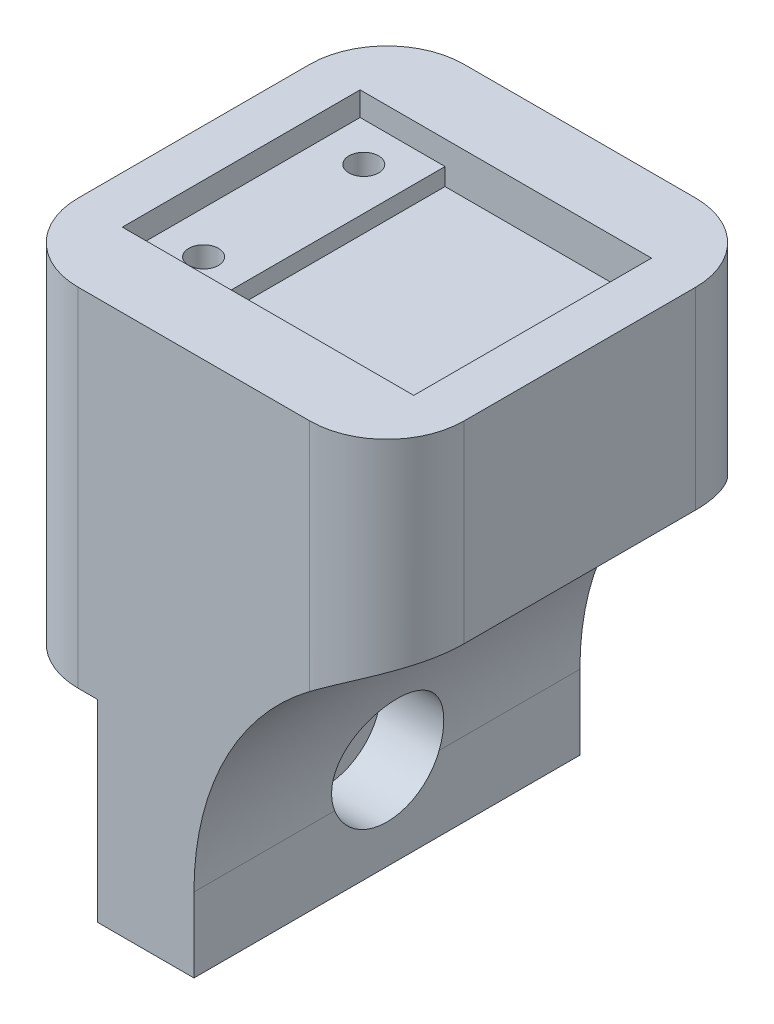
ISO-10303-21;
HEADER;
FILE_DESCRIPTION(('STEP AP214'),'2;1');
FILE_NAME('part.step','',(''),(''),'','','');
FILE_SCHEMA(('AUTOMOTIVE_DESIGN { 1 0 10303 214 1 1 1 1 }'));
ENDSEC;
DATA;
#1=APPLICATION_CONTEXT('core data for automotive mechanical design processes');
#2=APPLICATION_PROTOCOL_DEFINITION('international standard','automotive_design',2000,#1);
#3=PRODUCT_CONTEXT('',#1,'mechanical');
#4=PRODUCT('Part','Part','',(#3));
#5=PRODUCT_RELATED_PRODUCT_CATEGORY('part','',(#4));
#6=PRODUCT_DEFINITION_FORMATION('','',#4);
#7=PRODUCT_DEFINITION_CONTEXT('part definition',#1,'design');
#8=PRODUCT_DEFINITION('design','',#6,#7);
#9=PRODUCT_DEFINITION_SHAPE('','',#8);
#10=(LENGTH_UNIT() NAMED_UNIT(*) SI_UNIT(.MILLI.,.METRE.));
#11=(NAMED_UNIT(*) PLANE_ANGLE_UNIT() SI_UNIT($,.RADIAN.));
#12=(NAMED_UNIT(*) SI_UNIT($,.STERADIAN.) SOLID_ANGLE_UNIT());
#13=UNCERTAINTY_MEASURE_WITH_UNIT(LENGTH_MEASURE(1.E-05),#10,'distance_accuracy_value','');
#14=(GEOMETRIC_REPRESENTATION_CONTEXT(3) GLOBAL_UNCERTAINTY_ASSIGNED_CONTEXT((#13)) GLOBAL_UNIT_ASSIGNED_CONTEXT((#10,
#11,#12)) REPRESENTATION_CONTEXT('',''));
#15=CARTESIAN_POINT('',(0.,0.,0.));
#16=DIRECTION('',(0.,0.,1.));
#17=DIRECTION('',(1.,0.,0.));
#18=AXIS2_PLACEMENT_3D('',#15,#16,#17);
#19=CARTESIAN_POINT('',(6.35000000000001,-6.477,0.));
#20=DIRECTION('',(-1.,0.,0.));
#21=DIRECTION('',(0.,-1.,0.));
#22=AXIS2_PLACEMENT_3D('',#19,#20,#21);
#23=CYLINDRICAL_SURFACE('',#22,2.159);
#24=CARTESIAN_POINT('',(0.,-6.477,0.));
#25=DIRECTION('',(-1.,0.,0.));
#26=DIRECTION('',(0.,-1.,0.));
#27=AXIS2_PLACEMENT_3D('',#24,#25,#26);
#28=CIRCLE('',#27,2.159);
#29=CARTESIAN_POINT('',(0.,-8.636,0.));
#30=VERTEX_POINT('',#29);
#31=EDGE_CURVE('E243',#30,#30,#28,.T.);
#32=ORIENTED_EDGE('',*,*,#31,.T.);
#33=EDGE_LOOP('',(#32));
#34=FACE_BOUND('',#33,.T.);
#35=CARTESIAN_POINT('',(2.286,-6.477,0.));
#36=DIRECTION('',(1.,0.,0.));
#37=DIRECTION('',(0.,1.,0.));
#38=AXIS2_PLACEMENT_3D('',#35,#36,#37);
#39=CIRCLE('',#38,2.159);
#40=CARTESIAN_POINT('',(2.286,-4.318,0.));
#41=VERTEX_POINT('',#40);
#42=EDGE_CURVE('E236',#41,#41,#39,.T.);
#43=ORIENTED_EDGE('',*,*,#42,.T.);
#44=EDGE_LOOP('',(#43));
#45=FACE_BOUND('',#44,.T.);
#46=ADVANCED_FACE('F37',(#34,#45),#23,.F.);
#47=CARTESIAN_POINT('',(6.35,0.,12.7));
#48=DIRECTION('',(1.,0.,0.));
#49=DIRECTION('',(0.,1.,0.));
#50=AXIS2_PLACEMENT_3D('',#47,#48,#49);
#51=PLANE('',#50);
#52=DIRECTION('',(0.,-1.,0.));
#53=VECTOR('',#52,1.);
#54=CARTESIAN_POINT('',(6.35,0.,-12.7));
#55=LINE('',#54,#53);
#56=CARTESIAN_POINT('',(6.35,-7.80051224213831,-12.7));
#57=VERTEX_POINT('',#56);
#58=CARTESIAN_POINT('',(6.35,-12.7,-12.7));
#59=VERTEX_POINT('',#58);
#60=EDGE_CURVE('E248',#57,#59,#55,.T.);
#61=ORIENTED_EDGE('',*,*,#60,.F.);
#62=DIRECTION('',(0.,0.,1.));
#63=VECTOR('',#62,1.);
#64=CARTESIAN_POINT('',(6.35,-7.80051224213831,12.7));
#65=LINE('',#64,#63);
#66=CARTESIAN_POINT('',(6.35,-7.80051224213831,-3.43697604660114));
#67=VERTEX_POINT('',#66);
#68=EDGE_CURVE('E289',#57,#67,#65,.T.);
#69=ORIENTED_EDGE('',*,*,#68,.T.);
#70=CARTESIAN_POINT('',(6.35,-6.477,0.));
#71=DIRECTION('',(1.,0.,0.));
#72=DIRECTION('',(0.,1.,0.));
#73=AXIS2_PLACEMENT_3D('',#70,#71,#72);
#74=CIRCLE('',#73,3.683);
#75=CARTESIAN_POINT('',(6.35,-7.80051224213831,3.43697604660114));
#76=VERTEX_POINT('',#75);
#77=EDGE_CURVE('E239',#76,#67,#74,.T.);
#78=ORIENTED_EDGE('',*,*,#77,.F.);
#79=DIRECTION('',(0.,0.,1.));
#80=VECTOR('',#79,1.);
#81=CARTESIAN_POINT('',(6.35,-7.80051224213831,12.7));
#82=LINE('',#81,#80);
#83=CARTESIAN_POINT('',(6.35,-7.80051224213831,12.7));
#84=VERTEX_POINT('',#83);
#85=EDGE_CURVE('E287',#76,#84,#82,.T.);
#86=ORIENTED_EDGE('',*,*,#85,.T.);
#87=DIRECTION('',(0.,-1.,0.));
#88=VECTOR('',#87,1.);
#89=CARTESIAN_POINT('',(6.35,0.,12.7));
#90=LINE('',#89,#88);
#91=CARTESIAN_POINT('',(6.35,-12.7,12.7));
#92=VERTEX_POINT('',#91);
#93=EDGE_CURVE('E249',#84,#92,#90,.T.);
#94=ORIENTED_EDGE('',*,*,#93,.T.);
#95=DIRECTION('',(0.,0.,-1.));
#96=VECTOR('',#95,1.);
#97=CARTESIAN_POINT('',(6.35,-12.7,12.7));
#98=LINE('',#97,#96);
#99=EDGE_CURVE('E262',#92,#59,#98,.T.);
#100=ORIENTED_EDGE('',*,*,#99,.T.);
#101=EDGE_LOOP('',(#61,#69,#78,#86,#94,#100));
#102=FACE_BOUND('',#101,.T.);
#103=ADVANCED_FACE('F314',(#102),#51,.T.);
#104=CARTESIAN_POINT('',(0.,22.86,12.7));
#105=DIRECTION('',(0.,1.,0.));
#106=DIRECTION('',(0.,0.,1.));
#107=AXIS2_PLACEMENT_3D('',#104,#105,#106);
#108=PLANE('',#107);
#109=DIRECTION('',(0.,0.,1.));
#110=VECTOR('',#109,1.);
#111=CARTESIAN_POINT('',(-3.23850000000001,22.86,-7.8232));
#112=LINE('',#111,#110);
#113=CARTESIAN_POINT('',(-3.23850000000001,22.86,-7.8232));
#114=VERTEX_POINT('',#113);
#115=CARTESIAN_POINT('',(-3.23850000000001,22.86,7.8232));
#116=VERTEX_POINT('',#115);
#117=EDGE_CURVE('E205',#114,#116,#112,.T.);
#118=ORIENTED_EDGE('',*,*,#117,.F.);
#119=DIRECTION('',(-1.,0.,0.));
#120=VECTOR('',#119,1.);
#121=CARTESIAN_POINT('',(-3.23850000000001,22.86,-7.8232));
#122=LINE('',#121,#120);
#123=CARTESIAN_POINT('',(15.9385,22.86,-7.8232));
#124=VERTEX_POINT('',#123);
#125=EDGE_CURVE('E211',#124,#114,#122,.T.);
#126=ORIENTED_EDGE('',*,*,#125,.F.);
#127=DIRECTION('',(0.,0.,-1.));
#128=VECTOR('',#127,1.);
#129=CARTESIAN_POINT('',(15.9385,22.86,-7.8232));
#130=LINE('',#129,#128);
#131=CARTESIAN_POINT('',(15.9385,22.86,7.8232));
#132=VERTEX_POINT('',#131);
#133=EDGE_CURVE('E219',#132,#124,#130,.T.);
#134=ORIENTED_EDGE('',*,*,#133,.F.);
#135=DIRECTION('',(1.,0.,0.));
#136=VECTOR('',#135,1.);
#137=CARTESIAN_POINT('',(-3.23850000000001,22.86,7.8232));
#138=LINE('',#137,#136);
#139=EDGE_CURVE('E217',#116,#132,#138,.T.);
#140=ORIENTED_EDGE('',*,*,#139,.F.);
#141=EDGE_LOOP('',(#118,#126,#134,#140));
#142=FACE_BOUND('',#141,.T.);
#143=DIRECTION('',(1.,0.,0.));
#144=VECTOR('',#143,1.);
#145=CARTESIAN_POINT('',(0.,22.86,-12.7));
#146=LINE('',#145,#144);
#147=CARTESIAN_POINT('',(-1.27000000000001,22.86,-12.7));
#148=VERTEX_POINT('',#147);
#149=CARTESIAN_POINT('',(13.97,22.86,-12.7));
#150=VERTEX_POINT('',#149);
#151=EDGE_CURVE('E264',#148,#150,#146,.T.);
#152=ORIENTED_EDGE('',*,*,#151,.F.);
#153=CARTESIAN_POINT('',(-1.27000000000001,22.86,-7.62));
#154=DIRECTION('',(0.,1.,0.));
#155=DIRECTION('',(0.,0.,1.));
#156=AXIS2_PLACEMENT_3D('',#153,#154,#155);
#157=CIRCLE('',#156,5.08);
#158=CARTESIAN_POINT('',(-6.35000000000001,22.86,-7.62));
#159=VERTEX_POINT('',#158);
#160=EDGE_CURVE('E387',#148,#159,#157,.T.);
#161=ORIENTED_EDGE('',*,*,#160,.T.);
#162=DIRECTION('',(0.,0.,-1.));
#163=VECTOR('',#162,1.);
#164=CARTESIAN_POINT('',(-6.35000000000001,22.86,12.7));
#165=LINE('',#164,#163);
#166=CARTESIAN_POINT('',(-6.35000000000001,22.86,7.62));
#167=VERTEX_POINT('',#166);
#168=EDGE_CURVE('E284',#167,#159,#165,.T.);
#169=ORIENTED_EDGE('',*,*,#168,.F.);
#170=CARTESIAN_POINT('',(-1.27000000000001,22.86,7.62));
#171=DIRECTION('',(0.,1.,0.));
#172=DIRECTION('',(0.,0.,1.));
#173=AXIS2_PLACEMENT_3D('',#170,#171,#172);
#174=CIRCLE('',#173,5.08);
#175=CARTESIAN_POINT('',(-1.27000000000001,22.86,12.7));
#176=VERTEX_POINT('',#175);
#177=EDGE_CURVE('E400',#167,#176,#174,.T.);
#178=ORIENTED_EDGE('',*,*,#177,.T.);
#179=DIRECTION('',(1.,0.,0.));
#180=VECTOR('',#179,1.);
#181=CARTESIAN_POINT('',(0.,22.86,12.7));
#182=LINE('',#181,#180);
#183=CARTESIAN_POINT('',(13.97,22.86,12.7));
#184=VERTEX_POINT('',#183);
#185=EDGE_CURVE('E251',#176,#184,#182,.T.);
#186=ORIENTED_EDGE('',*,*,#185,.T.);
#187=CARTESIAN_POINT('',(13.97,22.86,7.62));
#188=DIRECTION('',(0.,1.,0.));
#189=DIRECTION('',(0.,0.,1.));
#190=AXIS2_PLACEMENT_3D('',#187,#188,#189);
#191=CIRCLE('',#190,5.08);
#192=CARTESIAN_POINT('',(19.05,22.86,7.62));
#193=VERTEX_POINT('',#192);
#194=EDGE_CURVE('E404',#184,#193,#191,.T.);
#195=ORIENTED_EDGE('',*,*,#194,.T.);
#196=DIRECTION('',(0.,0.,1.));
#197=VECTOR('',#196,1.);
#198=CARTESIAN_POINT('',(19.05,22.86,12.7));
#199=LINE('',#198,#197);
#200=CARTESIAN_POINT('',(19.05,22.86,-7.62));
#201=VERTEX_POINT('',#200);
#202=EDGE_CURVE('E233',#201,#193,#199,.T.);
#203=ORIENTED_EDGE('',*,*,#202,.F.);
#204=CARTESIAN_POINT('',(13.97,22.86,-7.62));
#205=DIRECTION('',(0.,1.,0.));
#206=DIRECTION('',(0.,0.,1.));
#207=AXIS2_PLACEMENT_3D('',#204,#205,#206);
#208=CIRCLE('',#207,5.08);
#209=EDGE_CURVE('E389',#201,#150,#208,.T.);
#210=ORIENTED_EDGE('',*,*,#209,.T.);
#211=EDGE_LOOP('',(#152,#161,#169,#178,#186,#195,#203,#210));
#212=FACE_BOUND('',#211,.T.);
#213=ADVANCED_FACE('F349',(#142,#212),#108,.T.);
#214=CARTESIAN_POINT('',(-6.35,0.,12.7));
#215=DIRECTION('',(1.,0.,0.));
#216=DIRECTION('',(0.,1.,0.));
#217=AXIS2_PLACEMENT_3D('',#214,#215,#216);
#218=PLANE('',#217);
#219=ORIENTED_EDGE('',*,*,#168,.T.);
#220=DIRECTION('',(0.,-1.,0.));
#221=VECTOR('',#220,1.);
#222=CARTESIAN_POINT('',(-6.35,0.,-7.62));
#223=LINE('',#222,#221);
#224=CARTESIAN_POINT('',(-6.35,0.,-7.62));
#225=VERTEX_POINT('',#224);
#226=EDGE_CURVE('E396',#159,#225,#223,.T.);
#227=ORIENTED_EDGE('',*,*,#226,.T.);
#228=DIRECTION('',(0.,0.,-1.));
#229=VECTOR('',#228,1.);
#230=CARTESIAN_POINT('',(-6.35,0.,12.7));
#231=LINE('',#230,#229);
#232=CARTESIAN_POINT('',(-6.35,0.,7.62));
#233=VERTEX_POINT('',#232);
#234=EDGE_CURVE('E281',#233,#225,#231,.T.);
#235=ORIENTED_EDGE('',*,*,#234,.F.);
#236=DIRECTION('',(0.,-1.,0.));
#237=VECTOR('',#236,1.);
#238=CARTESIAN_POINT('',(-6.35000000000001,22.86,7.62));
#239=LINE('',#238,#237);
#240=EDGE_CURVE('E413',#233,#167,#239,.F.);
#241=ORIENTED_EDGE('',*,*,#240,.T.);
#242=EDGE_LOOP('',(#219,#227,#235,#241));
#243=FACE_BOUND('',#242,.T.);
#244=ADVANCED_FACE('F372',(#243),#218,.F.);
#245=CARTESIAN_POINT('',(0.,0.,12.7));
#246=DIRECTION('',(0.,1.,0.));
#247=DIRECTION('',(-1.,0.,0.));
#248=AXIS2_PLACEMENT_3D('',#245,#246,#247);
#249=PLANE('',#248);
#250=ORIENTED_EDGE('',*,*,#234,.T.);
#251=CARTESIAN_POINT('',(-1.27,0.,-7.62));
#252=DIRECTION('',(0.,1.,0.));
#253=DIRECTION('',(-1.,0.,0.));
#254=AXIS2_PLACEMENT_3D('',#251,#252,#253);
#255=CIRCLE('',#254,5.08);
#256=CARTESIAN_POINT('',(-1.27,0.,-12.7));
#257=VERTEX_POINT('',#256);
#258=EDGE_CURVE('E409',#225,#257,#255,.F.);
#259=ORIENTED_EDGE('',*,*,#258,.T.);
#260=DIRECTION('',(1.,0.,0.));
#261=VECTOR('',#260,1.);
#262=CARTESIAN_POINT('',(0.,0.,-12.7));
#263=LINE('',#262,#261);
#264=CARTESIAN_POINT('',(0.,0.,-12.7));
#265=VERTEX_POINT('',#264);
#266=EDGE_CURVE('E267',#257,#265,#263,.T.);
#267=ORIENTED_EDGE('',*,*,#266,.T.);
#268=DIRECTION('',(0.,0.,-1.));
#269=VECTOR('',#268,1.);
#270=CARTESIAN_POINT('',(0.,0.,12.7));
#271=LINE('',#270,#269);
#272=CARTESIAN_POINT('',(0.,0.,12.7));
#273=VERTEX_POINT('',#272);
#274=EDGE_CURVE('E278',#273,#265,#271,.T.);
#275=ORIENTED_EDGE('',*,*,#274,.F.);
#276=DIRECTION('',(1.,0.,0.));
#277=VECTOR('',#276,1.);
#278=CARTESIAN_POINT('',(0.,0.,12.7));
#279=LINE('',#278,#277);
#280=CARTESIAN_POINT('',(-1.27,0.,12.7));
#281=VERTEX_POINT('',#280);
#282=EDGE_CURVE('E255',#281,#273,#279,.T.);
#283=ORIENTED_EDGE('',*,*,#282,.F.);
#284=CARTESIAN_POINT('',(-1.27,0.,7.62));
#285=DIRECTION('',(0.,1.,0.));
#286=DIRECTION('',(-1.,0.,0.));
#287=AXIS2_PLACEMENT_3D('',#284,#285,#286);
#288=CIRCLE('',#287,5.08);
#289=EDGE_CURVE('E411',#281,#233,#288,.F.);
#290=ORIENTED_EDGE('',*,*,#289,.T.);
#291=EDGE_LOOP('',(#250,#259,#267,#275,#283,#290));
#292=FACE_BOUND('',#291,.T.);
#293=ADVANCED_FACE('F368',(#292),#249,.F.);
#294=CARTESIAN_POINT('',(0.,0.,12.7));
#295=DIRECTION('',(1.,0.,0.));
#296=DIRECTION('',(0.,1.,0.));
#297=AXIS2_PLACEMENT_3D('',#294,#295,#296);
#298=PLANE('',#297);
#299=ORIENTED_EDGE('',*,*,#31,.F.);
#300=EDGE_LOOP('',(#299));
#301=FACE_BOUND('',#300,.T.);
#302=DIRECTION('',(0.,-1.,0.));
#303=VECTOR('',#302,1.);
#304=CARTESIAN_POINT('',(0.,0.,-12.7));
#305=LINE('',#304,#303);
#306=CARTESIAN_POINT('',(0.,-12.7,-12.7));
#307=VERTEX_POINT('',#306);
#308=EDGE_CURVE('E269',#265,#307,#305,.T.);
#309=ORIENTED_EDGE('',*,*,#308,.T.);
#310=DIRECTION('',(0.,0.,-1.));
#311=VECTOR('',#310,1.);
#312=CARTESIAN_POINT('',(0.,-12.7,12.7));
#313=LINE('',#312,#311);
#314=CARTESIAN_POINT('',(0.,-12.7,12.7));
#315=VERTEX_POINT('',#314);
#316=EDGE_CURVE('E275',#315,#307,#313,.T.);
#317=ORIENTED_EDGE('',*,*,#316,.F.);
#318=DIRECTION('',(0.,-1.,0.));
#319=VECTOR('',#318,1.);
#320=CARTESIAN_POINT('',(0.,0.,12.7));
#321=LINE('',#320,#319);
#322=EDGE_CURVE('E257',#273,#315,#321,.T.);
#323=ORIENTED_EDGE('',*,*,#322,.F.);
#324=ORIENTED_EDGE('',*,*,#274,.T.);
#325=EDGE_LOOP('',(#309,#317,#323,#324));
#326=FACE_BOUND('',#325,.T.);
#327=ADVANCED_FACE('F364',(#301,#326),#298,.F.);
#328=CARTESIAN_POINT('',(0.,-12.7,12.7));
#329=DIRECTION('',(0.,1.,0.));
#330=DIRECTION('',(-1.,0.,0.));
#331=AXIS2_PLACEMENT_3D('',#328,#329,#330);
#332=PLANE('',#331);
#333=DIRECTION('',(1.,0.,0.));
#334=VECTOR('',#333,1.);
#335=CARTESIAN_POINT('',(0.,-12.7,-12.7));
#336=LINE('',#335,#334);
#337=EDGE_CURVE('E252',#307,#59,#336,.T.);
#338=ORIENTED_EDGE('',*,*,#337,.T.);
#339=ORIENTED_EDGE('',*,*,#99,.F.);
#340=DIRECTION('',(1.,0.,0.));
#341=VECTOR('',#340,1.);
#342=CARTESIAN_POINT('',(0.,-12.7,12.7));
#343=LINE('',#342,#341);
#344=EDGE_CURVE('E259',#315,#92,#343,.T.);
#345=ORIENTED_EDGE('',*,*,#344,.F.);
#346=ORIENTED_EDGE('',*,*,#316,.T.);
#347=EDGE_LOOP('',(#338,#339,#345,#346));
#348=FACE_BOUND('',#347,.T.);
#349=ADVANCED_FACE('F357',(#348),#332,.F.);
#350=CARTESIAN_POINT('',(0.,0.,12.7));
#351=DIRECTION('',(0.,0.,1.));
#352=DIRECTION('',(1.,0.,0.));
#353=AXIS2_PLACEMENT_3D('',#350,#351,#352);
#354=PLANE('',#353);
#355=ORIENTED_EDGE('',*,*,#185,.F.);
#356=DIRECTION('',(0.,-1.,0.));
#357=VECTOR('',#356,1.);
#358=CARTESIAN_POINT('',(-1.27,0.,12.7));
#359=LINE('',#358,#357);
#360=EDGE_CURVE('E11',#176,#281,#359,.T.);
#361=ORIENTED_EDGE('',*,*,#360,.T.);
#362=ORIENTED_EDGE('',*,*,#282,.T.);
#363=ORIENTED_EDGE('',*,*,#322,.T.);
#364=ORIENTED_EDGE('',*,*,#344,.T.);
#365=ORIENTED_EDGE('',*,*,#93,.F.);
#366=CARTESIAN_POINT('',(25.4,-7.8005122421383,12.7));
#367=DIRECTION('',(0.,0.,1.));
#368=DIRECTION('',(1.,0.,0.));
#369=AXIS2_PLACEMENT_3D('',#366,#367,#368);
#370=CIRCLE('',#369,19.05);
#371=CARTESIAN_POINT('',(13.97,7.4394877578617,12.7));
#372=VERTEX_POINT('',#371);
#373=EDGE_CURVE('E301',#84,#372,#370,.F.);
#374=ORIENTED_EDGE('',*,*,#373,.T.);
#375=DIRECTION('',(0.,-1.,0.));
#376=VECTOR('',#375,1.);
#377=CARTESIAN_POINT('',(13.97,0.,12.7));
#378=LINE('',#377,#376);
#379=EDGE_CURVE('E46',#372,#184,#378,.F.);
#380=ORIENTED_EDGE('',*,*,#379,.T.);
#381=EDGE_LOOP('',(#355,#361,#362,#363,#364,#365,#374,#380));
#382=FACE_BOUND('',#381,.T.);
#383=ADVANCED_FACE('F353',(#382),#354,.T.);
#384=CARTESIAN_POINT('',(0.,0.,-12.7));
#385=DIRECTION('',(0.,0.,1.));
#386=DIRECTION('',(1.,0.,0.));
#387=AXIS2_PLACEMENT_3D('',#384,#385,#386);
#388=PLANE('',#387);
#389=ORIENTED_EDGE('',*,*,#266,.F.);
#390=DIRECTION('',(0.,-1.,0.));
#391=VECTOR('',#390,1.);
#392=CARTESIAN_POINT('',(-1.27,0.,-12.7));
#393=LINE('',#392,#391);
#394=EDGE_CURVE('E394',#257,#148,#393,.F.);
#395=ORIENTED_EDGE('',*,*,#394,.T.);
#396=ORIENTED_EDGE('',*,*,#151,.T.);
#397=DIRECTION('',(0.,1.,0.));
#398=VECTOR('',#397,1.);
#399=CARTESIAN_POINT('',(13.97,10.16,-12.7));
#400=LINE('',#399,#398);
#401=CARTESIAN_POINT('',(13.97,7.4394877578617,-12.7));
#402=VERTEX_POINT('',#401);
#403=EDGE_CURVE('E407',#150,#402,#400,.F.);
#404=ORIENTED_EDGE('',*,*,#403,.T.);
#405=CARTESIAN_POINT('',(25.4,-7.8005122421383,-12.7));
#406=DIRECTION('',(0.,0.,1.));
#407=DIRECTION('',(1.,0.,0.));
#408=AXIS2_PLACEMENT_3D('',#405,#406,#407);
#409=CIRCLE('',#408,19.05);
#410=EDGE_CURVE('E291',#402,#57,#409,.T.);
#411=ORIENTED_EDGE('',*,*,#410,.T.);
#412=ORIENTED_EDGE('',*,*,#60,.T.);
#413=ORIENTED_EDGE('',*,*,#337,.F.);
#414=ORIENTED_EDGE('',*,*,#308,.F.);
#415=EDGE_LOOP('',(#389,#395,#396,#404,#411,#412,#413,#414));
#416=FACE_BOUND('',#415,.T.);
#417=ADVANCED_FACE('F356',(#416),#388,.F.);
#418=CARTESIAN_POINT('',(2.286,-6.477,0.));
#419=DIRECTION('',(1.,0.,0.));
#420=DIRECTION('',(0.,1.,0.));
#421=AXIS2_PLACEMENT_3D('',#418,#419,#420);
#422=CYLINDRICAL_SURFACE('',#421,3.683);
#423=CARTESIAN_POINT('',(2.286,-6.477,0.));
#424=DIRECTION('',(1.,0.,0.));
#425=DIRECTION('',(0.,1.,0.));
#426=AXIS2_PLACEMENT_3D('',#423,#424,#425);
#427=CIRCLE('',#426,3.683);
#428=CARTESIAN_POINT('',(2.286,-2.794,0.));
#429=VERTEX_POINT('',#428);
#430=EDGE_CURVE('E240',#429,#429,#427,.T.);
#431=ORIENTED_EDGE('',*,*,#430,.F.);
#432=EDGE_LOOP('',(#431));
#433=FACE_BOUND('',#432,.T.);
#434=ORIENTED_EDGE('',*,*,#77,.T.);
#435=CARTESIAN_POINT('',(6.35,-7.80051224213831,-3.43697604660114));
#436=CARTESIAN_POINT('',(6.34999320728469,-7.70518619562024,-3.47369589744286));
#437=CARTESIAN_POINT('',(6.3507153291311,-7.60832823117715,-3.50642811391249));
#438=CARTESIAN_POINT('',(6.35370631729381,-7.41225683674622,-3.56373328164409));
#439=CARTESIAN_POINT('',(6.35597510111973,-7.31304353265153,-3.58830666794902));
#440=CARTESIAN_POINT('',(6.3621443019803,-7.11308938216757,-3.62908764705105));
#441=CARTESIAN_POINT('',(6.36604259707161,-7.01235068596767,-3.6453060585699));
#442=CARTESIAN_POINT('',(6.375499016466,-6.80998179432225,-3.66933369354177));
#443=CARTESIAN_POINT('',(6.38105711298576,-6.70835161382687,-3.67714305774322));
#444=CARTESIAN_POINT('',(6.40023371255698,-6.40310938836353,-3.68787064291266));
#445=CARTESIAN_POINT('',(6.41635727092941,-6.19905460426215,-3.67810680633451));
#446=CARTESIAN_POINT('',(6.4546654765816,-5.79604633874276,-3.62521220592292));
#447=CARTESIAN_POINT('',(6.47684977088027,-5.59709256097682,-3.58208338501939));
#448=CARTESIAN_POINT('',(6.52619273858322,-5.20809974484812,-3.46352399087587));
#449=CARTESIAN_POINT('',(6.55338612154298,-5.01813531789258,-3.38786278094376));
#450=CARTESIAN_POINT('',(6.6108078341255,-4.6536309135979,-3.20644518156167));
#451=CARTESIAN_POINT('',(6.64103704804404,-4.47909545850484,-3.10068000668959));
#452=CARTESIAN_POINT('',(6.70298153728171,-4.14629492881634,-2.85927926528496));
#453=CARTESIAN_POINT('',(6.73471487724529,-3.98847262164694,-2.72303737845573));
#454=CARTESIAN_POINT('',(6.79642887364752,-3.69785958187661,-2.42571314822963));
#455=CARTESIAN_POINT('',(6.82640952425889,-3.56506893249661,-2.26463072225044));
#456=CARTESIAN_POINT('',(6.88215047110165,-3.32762164942584,-1.92087825051074));
#457=CARTESIAN_POINT('',(6.90788647157101,-3.22312492021382,-1.73809357563943));
#458=CARTESIAN_POINT('',(6.95248823260638,-3.0465500873193,-1.35670131287096));
#459=CARTESIAN_POINT('',(6.97135512275023,-2.97446665303524,-1.15809633306647));
#460=CARTESIAN_POINT('',(6.99995075621327,-2.86657371084573,-0.756006387485977));
#461=CARTESIAN_POINT('',(7.00989725495566,-2.82989804724198,-0.55276952997625));
#462=CARTESIAN_POINT('',(7.02044932044491,-2.79101686716164,-0.142801554854217));
#463=CARTESIAN_POINT('',(7.02105667332611,-2.78880475944519,0.0639288870299611));
#464=CARTESIAN_POINT('',(7.01298404883436,-2.81850970520414,0.4691723025135));
#465=CARTESIAN_POINT('',(7.00455078372029,-2.84952012432668,0.66775755680657));
#466=CARTESIAN_POINT('',(6.97959477738464,-2.94319859243538,1.05677321500725));
#467=CARTESIAN_POINT('',(6.96307167800441,-3.00586804305566,1.2472032574558));
#468=CARTESIAN_POINT('',(6.92332243724394,-3.16140319327506,1.61605897546497));
#469=CARTESIAN_POINT('',(6.90005167906195,-3.25447042428585,1.79439466585896));
#470=CARTESIAN_POINT('',(6.84889598831358,-3.46795501221634,2.13312802212269));
#471=CARTESIAN_POINT('',(6.82101032830188,-3.58837668212314,2.29352285329062));
#472=CARTESIAN_POINT('',(6.76201795090239,-3.85746351435503,2.5970977044284));
#473=CARTESIAN_POINT('',(6.73083826386592,-4.00688731685883,2.7395914709766));
#474=CARTESIAN_POINT('',(6.66856178259532,-4.32742380311477,2.99769278675164));
#475=CARTESIAN_POINT('',(6.63746499980611,-4.49853933764069,3.11329679639774));
#476=CARTESIAN_POINT('',(6.57723565533645,-4.86106855003131,3.31619099416669));
#477=CARTESIAN_POINT('',(6.54814539212603,-5.05277745908596,3.40296729440961));
#478=CARTESIAN_POINT('',(6.49466548822156,-5.44876962200758,3.54278181432861));
#479=CARTESIAN_POINT('',(6.47027572441193,-5.65305254635073,3.59582091773374));
#480=CARTESIAN_POINT('',(6.42804869502356,-6.06557637732429,3.6658470296974));
#481=CARTESIAN_POINT('',(6.41012990539457,-6.27373057903828,3.68329646754119));
#482=CARTESIAN_POINT('',(6.38122809686976,-6.69041437832725,3.68269655482744));
#483=CARTESIAN_POINT('',(6.37023962199593,-6.8989435506633,3.66467517529832));
#484=CARTESIAN_POINT('',(6.35837361399868,-7.22327064310926,3.60862420123586));
#485=CARTESIAN_POINT('',(6.35518664695592,-7.34111591223146,3.5822260205699));
#486=CARTESIAN_POINT('',(6.35099699371923,-7.57350121751872,3.51805119218936));
#487=CARTESIAN_POINT('',(6.34999078214324,-7.68804629244744,3.48029302161677));
#488=CARTESIAN_POINT('',(6.35,-7.80051224213831,3.43697604660114));
#489=B_SPLINE_CURVE_WITH_KNOTS('',3,(#435,#436,#437,#438,#439,#440,#441,#442,#443,#444,#445,
#446,#447,#448,#449,#450,#451,#452,#453,#454,#455,#456,#457,#458,#459,#460,#461,#462,#463,#464,
#465,#466,#467,#468,#469,#470,#471,#472,#473,#474,#475,#476,#477,#478,#479,#480,#481,#482,#483,
#484,#485,#486,#487,#488),.UNSPECIFIED.,.F.,.F.,(4,2,2,2,2,2,2,2,2,2,2,2,2,2,2,2,2,2,2,2,2,2,2,
2,2,2,4),(0.,0.306363439106131,0.612710539758786,0.918659953051377,1.22460424536282,
1.83621751997945,2.4477951814435,3.06378199102805,3.67994875241037,4.30968002909534,
4.93941339936569,5.57263477938168,6.20575198342599,6.82295674479883,7.44004346279298,
8.04070907232122,8.64140127733159,9.24615965950294,9.85101346047609,10.4745833061032,
11.0982351877384,11.7324725810508,12.3666933601464,12.9926195897961,13.6180524339691,
13.9799322800358,14.3412266779406),.UNSPECIFIED.);
#490=EDGE_CURVE('E293',#67,#76,#489,.T.);
#491=ORIENTED_EDGE('',*,*,#490,.T.);
#492=EDGE_LOOP('',(#434,#491));
#493=FACE_BOUND('',#492,.T.);
#494=ADVANCED_FACE('F303',(#433,#493),#422,.F.);
#495=CARTESIAN_POINT('',(2.286,-6.477,0.));
#496=DIRECTION('',(1.,0.,0.));
#497=DIRECTION('',(0.,1.,0.));
#498=AXIS2_PLACEMENT_3D('',#495,#496,#497);
#499=PLANE('',#498);
#500=ORIENTED_EDGE('',*,*,#42,.F.);
#501=EDGE_LOOP('',(#500));
#502=FACE_BOUND('',#501,.T.);
#503=ORIENTED_EDGE('',*,*,#430,.T.);
#504=EDGE_LOOP('',(#503));
#505=FACE_BOUND('',#504,.T.);
#506=ADVANCED_FACE('F433',(#502,#505),#499,.T.);
#507=CARTESIAN_POINT('',(19.05,0.,0.));
#508=DIRECTION('',(1.,0.,0.));
#509=DIRECTION('',(0.,1.,0.));
#510=AXIS2_PLACEMENT_3D('',#507,#508,#509);
#511=PLANE('',#510);
#512=DIRECTION('',(0.,0.,-1.));
#513=VECTOR('',#512,1.);
#514=CARTESIAN_POINT('',(19.05,10.16,12.7));
#515=LINE('',#514,#513);
#516=CARTESIAN_POINT('',(19.05,10.16,7.62));
#517=VERTEX_POINT('',#516);
#518=CARTESIAN_POINT('',(19.05,10.16,-7.62));
#519=VERTEX_POINT('',#518);
#520=EDGE_CURVE('E226',#517,#519,#515,.T.);
#521=ORIENTED_EDGE('',*,*,#520,.T.);
#522=DIRECTION('',(0.,1.,0.));
#523=VECTOR('',#522,1.);
#524=CARTESIAN_POINT('',(19.05,22.86,-7.62));
#525=LINE('',#524,#523);
#526=EDGE_CURVE('E326',#519,#201,#525,.T.);
#527=ORIENTED_EDGE('',*,*,#526,.T.);
#528=ORIENTED_EDGE('',*,*,#202,.T.);
#529=DIRECTION('',(0.,-1.,0.));
#530=VECTOR('',#529,1.);
#531=CARTESIAN_POINT('',(19.05,0.,7.62));
#532=LINE('',#531,#530);
#533=EDGE_CURVE('E397',#193,#517,#532,.T.);
#534=ORIENTED_EDGE('',*,*,#533,.T.);
#535=EDGE_LOOP('',(#521,#527,#528,#534));
#536=FACE_BOUND('',#535,.T.);
#537=ADVANCED_FACE('F424',(#536),#511,.T.);
#538=CARTESIAN_POINT('',(-3.23850000000001,21.2852,-7.8232));
#539=DIRECTION('',(-1.,0.,0.));
#540=DIRECTION('',(0.,0.,1.));
#541=AXIS2_PLACEMENT_3D('',#538,#539,#540);
#542=PLANE('',#541);
#543=ORIENTED_EDGE('',*,*,#117,.T.);
#544=DIRECTION('',(0.,1.,0.));
#545=VECTOR('',#544,1.);
#546=CARTESIAN_POINT('',(-3.23850000000001,21.2852,7.8232));
#547=LINE('',#546,#545);
#548=CARTESIAN_POINT('',(-3.23850000000001,21.2852,7.8232));
#549=VERTEX_POINT('',#548);
#550=EDGE_CURVE('E215',#549,#116,#547,.T.);
#551=ORIENTED_EDGE('',*,*,#550,.F.);
#552=DIRECTION('',(0.,0.,1.));
#553=VECTOR('',#552,1.);
#554=CARTESIAN_POINT('',(-3.23850000000001,21.2852,-7.8232));
#555=LINE('',#554,#553);
#556=CARTESIAN_POINT('',(-3.23850000000001,21.2852,-7.8232));
#557=VERTEX_POINT('',#556);
#558=EDGE_CURVE('E207',#557,#549,#555,.T.);
#559=ORIENTED_EDGE('',*,*,#558,.F.);
#560=DIRECTION('',(0.,1.,0.));
#561=VECTOR('',#560,1.);
#562=CARTESIAN_POINT('',(-3.23850000000001,21.2852,-7.8232));
#563=LINE('',#562,#561);
#564=EDGE_CURVE('E224',#557,#114,#563,.T.);
#565=ORIENTED_EDGE('',*,*,#564,.T.);
#566=EDGE_LOOP('',(#543,#551,#559,#565));
#567=FACE_BOUND('',#566,.T.);
#568=ADVANCED_FACE('F444',(#567),#542,.F.);
#569=CARTESIAN_POINT('',(-3.23850000000001,21.2852,-7.8232));
#570=DIRECTION('',(0.,0.,-1.));
#571=DIRECTION('',(-1.,0.,0.));
#572=AXIS2_PLACEMENT_3D('',#569,#570,#571);
#573=PLANE('',#572);
#574=ORIENTED_EDGE('',*,*,#125,.T.);
#575=ORIENTED_EDGE('',*,*,#564,.F.);
#576=DIRECTION('',(-1.,0.,0.));
#577=VECTOR('',#576,1.);
#578=CARTESIAN_POINT('',(-3.23850000000001,21.2852,-7.8232));
#579=LINE('',#578,#577);
#580=CARTESIAN_POINT('',(2.34949999999999,21.2852,-7.8232));
#581=VERTEX_POINT('',#580);
#582=EDGE_CURVE('E213',#581,#557,#579,.T.);
#583=ORIENTED_EDGE('',*,*,#582,.F.);
#584=DIRECTION('',(0.,1.,0.));
#585=VECTOR('',#584,1.);
#586=CARTESIAN_POINT('',(2.34949999999999,20.1422,-7.8232));
#587=LINE('',#586,#585);
#588=CARTESIAN_POINT('',(2.34949999999999,20.1422,-7.8232));
#589=VERTEX_POINT('',#588);
#590=EDGE_CURVE('E181',#589,#581,#587,.T.);
#591=ORIENTED_EDGE('',*,*,#590,.F.);
#592=DIRECTION('',(-1.,0.,0.));
#593=VECTOR('',#592,1.);
#594=CARTESIAN_POINT('',(2.34949999999999,20.1422,-7.8232));
#595=LINE('',#594,#593);
#596=CARTESIAN_POINT('',(15.9385,20.1422,-7.8232));
#597=VERTEX_POINT('',#596);
#598=EDGE_CURVE('E182',#597,#589,#595,.T.);
#599=ORIENTED_EDGE('',*,*,#598,.F.);
#600=DIRECTION('',(0.,1.,0.));
#601=VECTOR('',#600,1.);
#602=CARTESIAN_POINT('',(15.9385,21.2852,-7.8232));
#603=LINE('',#602,#601);
#604=EDGE_CURVE('E227',#597,#124,#603,.T.);
#605=ORIENTED_EDGE('',*,*,#604,.T.);
#606=EDGE_LOOP('',(#574,#575,#583,#591,#599,#605));
#607=FACE_BOUND('',#606,.T.);
#608=ADVANCED_FACE('F450',(#607),#573,.F.);
#609=CARTESIAN_POINT('',(15.9385,21.2852,-7.8232));
#610=DIRECTION('',(1.,0.,0.));
#611=DIRECTION('',(0.,0.,-1.));
#612=AXIS2_PLACEMENT_3D('',#609,#610,#611);
#613=PLANE('',#612);
#614=ORIENTED_EDGE('',*,*,#133,.T.);
#615=ORIENTED_EDGE('',*,*,#604,.F.);
#616=DIRECTION('',(0.,0.,-1.));
#617=VECTOR('',#616,1.);
#618=CARTESIAN_POINT('',(15.9385,20.1422,-7.8232));
#619=LINE('',#618,#617);
#620=CARTESIAN_POINT('',(15.9385,20.1422,7.8232));
#621=VERTEX_POINT('',#620);
#622=EDGE_CURVE('E192',#621,#597,#619,.T.);
#623=ORIENTED_EDGE('',*,*,#622,.F.);
#624=DIRECTION('',(0.,1.,0.));
#625=VECTOR('',#624,1.);
#626=CARTESIAN_POINT('',(15.9385,21.2852,7.8232));
#627=LINE('',#626,#625);
#628=EDGE_CURVE('E188',#621,#132,#627,.T.);
#629=ORIENTED_EDGE('',*,*,#628,.T.);
#630=EDGE_LOOP('',(#614,#615,#623,#629));
#631=FACE_BOUND('',#630,.T.);
#632=ADVANCED_FACE('F455',(#631),#613,.F.);
#633=CARTESIAN_POINT('',(-3.23850000000001,21.2852,7.8232));
#634=DIRECTION('',(0.,0.,1.));
#635=DIRECTION('',(1.,0.,0.));
#636=AXIS2_PLACEMENT_3D('',#633,#634,#635);
#637=PLANE('',#636);
#638=ORIENTED_EDGE('',*,*,#139,.T.);
#639=ORIENTED_EDGE('',*,*,#628,.F.);
#640=DIRECTION('',(1.,0.,0.));
#641=VECTOR('',#640,1.);
#642=CARTESIAN_POINT('',(2.34949999999999,20.1422,7.8232));
#643=LINE('',#642,#641);
#644=CARTESIAN_POINT('',(2.34949999999999,20.1422,7.8232));
#645=VERTEX_POINT('',#644);
#646=EDGE_CURVE('E185',#645,#621,#643,.T.);
#647=ORIENTED_EDGE('',*,*,#646,.F.);
#648=DIRECTION('',(0.,1.,0.));
#649=VECTOR('',#648,1.);
#650=CARTESIAN_POINT('',(2.34949999999999,20.1422,7.8232));
#651=LINE('',#650,#649);
#652=CARTESIAN_POINT('',(2.34949999999999,21.2852,7.8232));
#653=VERTEX_POINT('',#652);
#654=EDGE_CURVE('E170',#645,#653,#651,.T.);
#655=ORIENTED_EDGE('',*,*,#654,.T.);
#656=DIRECTION('',(1.,0.,0.));
#657=VECTOR('',#656,1.);
#658=CARTESIAN_POINT('',(-3.23850000000001,21.2852,7.8232));
#659=LINE('',#658,#657);
#660=EDGE_CURVE('E210',#549,#653,#659,.T.);
#661=ORIENTED_EDGE('',*,*,#660,.F.);
#662=ORIENTED_EDGE('',*,*,#550,.T.);
#663=EDGE_LOOP('',(#638,#639,#647,#655,#661,#662));
#664=FACE_BOUND('',#663,.T.);
#665=ADVANCED_FACE('F187',(#664),#637,.F.);
#666=CARTESIAN_POINT('',(0.,21.2852,0.));
#667=DIRECTION('',(0.,1.,0.));
#668=DIRECTION('',(0.,0.,1.));
#669=AXIS2_PLACEMENT_3D('',#666,#667,#668);
#670=PLANE('',#669);
#671=CARTESIAN_POINT('',(-0.444500000000014,21.2852,5.27049999999999));
#672=DIRECTION('',(0.,-1.,0.));
#673=DIRECTION('',(0.,0.,-1.));
#674=AXIS2_PLACEMENT_3D('',#671,#672,#673);
#675=CIRCLE('',#674,0.9779);
#676=CARTESIAN_POINT('',(-0.444500000000014,21.2852,4.29259999999999));
#677=VERTEX_POINT('',#676);
#678=EDGE_CURVE('E487',#677,#677,#675,.T.);
#679=ORIENTED_EDGE('',*,*,#678,.T.);
#680=EDGE_LOOP('',(#679));
#681=FACE_BOUND('',#680,.T.);
#682=CARTESIAN_POINT('',(-0.444500000000004,21.2852,-5.27050000000001));
#683=DIRECTION('',(0.,-1.,0.));
#684=DIRECTION('',(0.,0.,-1.));
#685=AXIS2_PLACEMENT_3D('',#682,#683,#684);
#686=CIRCLE('',#685,0.9779);
#687=CARTESIAN_POINT('',(-0.444500000000004,21.2852,-6.24840000000001));
#688=VERTEX_POINT('',#687);
#689=EDGE_CURVE('E490',#688,#688,#686,.T.);
#690=ORIENTED_EDGE('',*,*,#689,.T.);
#691=EDGE_LOOP('',(#690));
#692=FACE_BOUND('',#691,.T.);
#693=DIRECTION('',(0.,0.,1.));
#694=VECTOR('',#693,1.);
#695=CARTESIAN_POINT('',(2.34949999999999,21.2852,-7.8232));
#696=LINE('',#695,#694);
#697=EDGE_CURVE('E177',#581,#653,#696,.T.);
#698=ORIENTED_EDGE('',*,*,#697,.F.);
#699=ORIENTED_EDGE('',*,*,#582,.T.);
#700=ORIENTED_EDGE('',*,*,#558,.T.);
#701=ORIENTED_EDGE('',*,*,#660,.T.);
#702=EDGE_LOOP('',(#698,#699,#700,#701));
#703=FACE_BOUND('',#702,.T.);
#704=ADVANCED_FACE('F454',(#681,#692,#703),#670,.T.);
#705=CARTESIAN_POINT('',(2.34949999999999,20.1422,-7.8232));
#706=DIRECTION('',(-1.,0.,0.));
#707=DIRECTION('',(0.,0.,1.));
#708=AXIS2_PLACEMENT_3D('',#705,#706,#707);
#709=PLANE('',#708);
#710=ORIENTED_EDGE('',*,*,#697,.T.);
#711=ORIENTED_EDGE('',*,*,#654,.F.);
#712=DIRECTION('',(0.,0.,1.));
#713=VECTOR('',#712,1.);
#714=CARTESIAN_POINT('',(2.34949999999999,20.1422,-7.8232));
#715=LINE('',#714,#713);
#716=EDGE_CURVE('E174',#589,#645,#715,.T.);
#717=ORIENTED_EDGE('',*,*,#716,.F.);
#718=ORIENTED_EDGE('',*,*,#590,.T.);
#719=EDGE_LOOP('',(#710,#711,#717,#718));
#720=FACE_BOUND('',#719,.T.);
#721=ADVANCED_FACE('F172',(#720),#709,.F.);
#722=CARTESIAN_POINT('',(0.,20.1422,0.));
#723=DIRECTION('',(0.,1.,0.));
#724=DIRECTION('',(0.,0.,1.));
#725=AXIS2_PLACEMENT_3D('',#722,#723,#724);
#726=PLANE('',#725);
#727=ORIENTED_EDGE('',*,*,#716,.T.);
#728=ORIENTED_EDGE('',*,*,#646,.T.);
#729=ORIENTED_EDGE('',*,*,#622,.T.);
#730=ORIENTED_EDGE('',*,*,#598,.T.);
#731=EDGE_LOOP('',(#727,#728,#729,#730));
#732=FACE_BOUND('',#731,.T.);
#733=ADVANCED_FACE('F194',(#732),#726,.T.);
#734=CARTESIAN_POINT('',(-0.444500000000004,8.5852,-5.27050000000001));
#735=DIRECTION('',(0.,1.,0.));
#736=DIRECTION('',(0.,0.,1.));
#737=AXIS2_PLACEMENT_3D('',#734,#735,#736);
#738=CYLINDRICAL_SURFACE('',#737,0.9779);
#739=CARTESIAN_POINT('',(-0.444500000000004,8.5852,-5.27050000000001));
#740=DIRECTION('',(0.,-1.,0.));
#741=DIRECTION('',(0.,0.,-1.));
#742=AXIS2_PLACEMENT_3D('',#739,#740,#741);
#743=CIRCLE('',#742,0.9779);
#744=CARTESIAN_POINT('',(-0.444500000000004,8.5852,-6.24840000000001));
#745=VERTEX_POINT('',#744);
#746=EDGE_CURVE('E200',#745,#745,#743,.T.);
#747=ORIENTED_EDGE('',*,*,#746,.T.);
#748=EDGE_LOOP('',(#747));
#749=FACE_BOUND('',#748,.T.);
#750=ORIENTED_EDGE('',*,*,#689,.F.);
#751=EDGE_LOOP('',(#750));
#752=FACE_BOUND('',#751,.T.);
#753=ADVANCED_FACE('F469',(#749,#752),#738,.F.);
#754=CARTESIAN_POINT('',(-0.444500000000004,8.5852,-5.27050000000001));
#755=DIRECTION('',(0.,-1.,0.));
#756=DIRECTION('',(0.,0.,-1.));
#757=AXIS2_PLACEMENT_3D('',#754,#755,#756);
#758=PLANE('',#757);
#759=ORIENTED_EDGE('',*,*,#746,.F.);
#760=EDGE_LOOP('',(#759));
#761=FACE_BOUND('',#760,.T.);
#762=ADVANCED_FACE('F470',(#761),#758,.F.);
#763=CARTESIAN_POINT('',(-0.444500000000014,8.5852,5.27049999999999));
#764=DIRECTION('',(0.,1.,0.));
#765=DIRECTION('',(0.,0.,1.));
#766=AXIS2_PLACEMENT_3D('',#763,#764,#765);
#767=CYLINDRICAL_SURFACE('',#766,0.9779);
#768=CARTESIAN_POINT('',(-0.444500000000014,8.5852,5.27049999999999));
#769=DIRECTION('',(0.,-1.,0.));
#770=DIRECTION('',(0.,0.,-1.));
#771=AXIS2_PLACEMENT_3D('',#768,#769,#770);
#772=CIRCLE('',#771,0.9779);
#773=CARTESIAN_POINT('',(-0.444500000000014,8.5852,4.29259999999999));
#774=VERTEX_POINT('',#773);
#775=EDGE_CURVE('E197',#774,#774,#772,.T.);
#776=ORIENTED_EDGE('',*,*,#775,.T.);
#777=EDGE_LOOP('',(#776));
#778=FACE_BOUND('',#777,.T.);
#779=ORIENTED_EDGE('',*,*,#678,.F.);
#780=EDGE_LOOP('',(#779));
#781=FACE_BOUND('',#780,.T.);
#782=ADVANCED_FACE('F473',(#778,#781),#767,.F.);
#783=CARTESIAN_POINT('',(-0.444500000000014,8.5852,5.27049999999999));
#784=DIRECTION('',(0.,-1.,0.));
#785=DIRECTION('',(0.,0.,-1.));
#786=AXIS2_PLACEMENT_3D('',#783,#784,#785);
#787=PLANE('',#786);
#788=ORIENTED_EDGE('',*,*,#775,.F.);
#789=EDGE_LOOP('',(#788));
#790=FACE_BOUND('',#789,.T.);
#791=ADVANCED_FACE('F313',(#790),#787,.F.);
#792=CARTESIAN_POINT('',(25.4,-7.8005122421383,12.7));
#793=DIRECTION('',(0.,0.,-1.));
#794=DIRECTION('',(-1.,0.,0.));
#795=AXIS2_PLACEMENT_3D('',#792,#793,#794);
#796=CYLINDRICAL_SURFACE('',#795,19.05);
#797=ORIENTED_EDGE('',*,*,#410,.F.);
#798=CARTESIAN_POINT('',(13.97,7.43948775786169,-12.7));
#799=CARTESIAN_POINT('',(14.1140326883675,7.54753977716261,-12.7000047836035));
#800=CARTESIAN_POINT('',(14.2596745219039,7.65355350473613,-12.6938727823497));
#801=CARTESIAN_POINT('',(14.553296615294,7.8610219781395,-12.6685538735921));
#802=CARTESIAN_POINT('',(14.7012793757414,7.96247133131081,-12.6493519349189));
#803=CARTESIAN_POINT('',(14.9990213890594,8.16051233707464,-12.5969931338001));
#804=CARTESIAN_POINT('',(15.1487855968158,8.25708061204003,-12.5637751463123));
#805=CARTESIAN_POINT('',(15.4480230992322,8.444233227248,-12.4827006514639));
#806=CARTESIAN_POINT('',(15.5974964989476,8.53482041443858,-12.4348511705483));
#807=CARTESIAN_POINT('',(15.8719607171466,8.69616383578777,-12.3324314683308));
#808=CARTESIAN_POINT('',(15.9972107651253,8.76783824660714,-12.279997114043));
#809=CARTESIAN_POINT('',(16.2453407594578,8.90621962935055,-12.1640047534961));
#810=CARTESIAN_POINT('',(16.3682202385484,8.97292562921544,-12.1004445786001));
#811=CARTESIAN_POINT('',(16.610122673228,9.10094467035513,-11.9622931370843));
#812=CARTESIAN_POINT('',(16.7291534465295,9.16226914276028,-11.8877262014563));
#813=CARTESIAN_POINT('',(16.9623745017227,9.27947629636414,-11.7275664060683));
#814=CARTESIAN_POINT('',(17.0765652185589,9.33535946712521,-11.641974539851));
#815=CARTESIAN_POINT('',(17.2994342830865,9.44183892470484,-11.4595463696484));
#816=CARTESIAN_POINT('',(17.4080791448133,9.49240469293679,-11.362651246732));
#817=CARTESIAN_POINT('',(17.6178313926912,9.5878064067693,-11.1585211766839));
#818=CARTESIAN_POINT('',(17.7189418663099,9.6326447048322,-11.0512905066642));
#819=CARTESIAN_POINT('',(17.9124859626605,9.71664437609985,-10.8270479875621));
#820=CARTESIAN_POINT('',(18.0049130538345,9.75580148783147,-10.7100288988263));
#821=CARTESIAN_POINT('',(18.1798195881085,9.8284544737612,-10.4671407689282));
#822=CARTESIAN_POINT('',(18.2622999955226,9.86195089688002,-10.3412725875462));
#823=CARTESIAN_POINT('',(18.4097927397619,9.92081022904296,-10.0926003400461));
#824=CARTESIAN_POINT('',(18.4756901570232,9.94661982515588,-9.97042573636799));
#825=CARTESIAN_POINT('',(18.5975422834667,9.99368166995787,-9.7203792681442));
#826=CARTESIAN_POINT('',(18.6534976628683,10.0149342258692,-9.59250778836757));
#827=CARTESIAN_POINT('',(18.7548253626094,10.0529771837755,-9.33211690139589));
#828=CARTESIAN_POINT('',(18.8002064767992,10.0697712951671,-9.19960146252601));
#829=CARTESIAN_POINT('',(18.8799515742526,10.0990203682515,-8.93088658199839));
#830=CARTESIAN_POINT('',(18.9143185901633,10.111476524449,-8.79468816563943));
#831=CARTESIAN_POINT('',(18.9785002393164,10.1346012225761,-8.4869031454182));
#832=CARTESIAN_POINT('',(19.0053013672534,10.1441448891342,-8.31458559325362));
#833=CARTESIAN_POINT('',(19.0321117591287,10.1536676085557,-8.05475662251644));
#834=CARTESIAN_POINT('',(19.0388166629001,10.1560430593315,-7.96796245784965));
#835=CARTESIAN_POINT('',(19.0477606442173,10.1592084804224,-7.7941189065562));
#836=CARTESIAN_POINT('',(19.0499998973774,10.1599985130849,-7.70706953010074));
#837=CARTESIAN_POINT('',(19.05,10.16,-7.62));
#838=B_SPLINE_CURVE_WITH_KNOTS('',3,(#798,#799,#800,#801,#802,#803,#804,#805,#806,#807,#808,
#809,#810,#811,#812,#813,#814,#815,#816,#817,#818,#819,#820,#821,#822,#823,#824,#825,#826,#827,
#828,#829,#830,#831,#832,#833,#834,#835,#836,#837),.UNSPECIFIED.,.F.,.F.,(4,2,2,2,2,2,2,2,2,2,2,
2,2,2,2,2,2,2,2,4),(0.,0.540145741635682,1.0809137334512,1.62406483592933,2.16695551088563,
2.62710236917538,3.08733901903005,3.54657312023668,4.00576586518454,4.46746473054175,
4.92897334685629,5.39082637185013,5.85263458491964,6.27568355833594,6.69870400205903,
7.12137138463917,7.54392228882276,8.0667034800873,8.32784977442862,8.58898579883325),.UNSPECIFIED.);
#839=EDGE_CURVE('E59',#402,#519,#838,.T.);
#840=ORIENTED_EDGE('',*,*,#839,.T.);
#841=ORIENTED_EDGE('',*,*,#520,.F.);
#842=CARTESIAN_POINT('',(19.05,10.16,7.62));
#843=CARTESIAN_POINT('',(19.0500186869022,10.1599949568691,7.75543718153517));
#844=CARTESIAN_POINT('',(19.044584491161,10.1580849668385,7.89087165513233));
#845=CARTESIAN_POINT('',(19.0229452012993,10.1504185310414,8.16075777771575));
#846=CARTESIAN_POINT('',(19.0067409311905,10.1446623795421,8.29520950109604));
#847=CARTESIAN_POINT('',(18.9637276668955,10.1292782804078,8.56197932583592));
#848=CARTESIAN_POINT('',(18.9369341520616,10.1196559839612,8.69430024945965));
#849=CARTESIAN_POINT('',(18.8730068265878,10.0964713815294,8.95606592148852));
#850=CARTESIAN_POINT('',(18.8358731091076,10.082909111041,9.08551069579488));
#851=CARTESIAN_POINT('',(18.7516177221191,10.0517572677912,9.34063441425064));
#852=CARTESIAN_POINT('',(18.7044942877222,10.0341669833543,9.46631268848649));
#853=CARTESIAN_POINT('',(18.600707611347,9.99485798808599,9.71305190391464));
#854=CARTESIAN_POINT('',(18.5440408678533,9.97313776156748,9.83411113027224));
#855=CARTESIAN_POINT('',(18.4217652597005,9.92548676513293,10.0706958057771));
#856=CARTESIAN_POINT('',(18.3561599896573,9.89955768700257,10.1862234543291));
#857=CARTESIAN_POINT('',(18.2166161857765,9.8433862285308,10.4110870189839));
#858=CARTESIAN_POINT('',(18.1426745713237,9.81314225255759,10.5204206235648));
#859=CARTESIAN_POINT('',(17.9865627923193,9.74801072858807,10.73306360778));
#860=CARTESIAN_POINT('',(17.9043291463314,9.71308655779639,10.836315142429));
#861=CARTESIAN_POINT('',(17.7329467818517,9.63874003939317,11.0352414839029));
#862=CARTESIAN_POINT('',(17.6437955573197,9.59931605917084,11.1309135192865));
#863=CARTESIAN_POINT('',(17.4595391211522,9.51600571911422,11.3141011436741));
#864=CARTESIAN_POINT('',(17.3644377920799,9.47212225774778,11.4016219606037));
#865=CARTESIAN_POINT('',(17.1691005391158,9.37989702451711,11.568245585375));
#866=CARTESIAN_POINT('',(17.0688627733701,9.33155364834606,11.6473453418066));
#867=CARTESIAN_POINT('',(16.8598922411373,9.22838080165701,11.7999953792455));
#868=CARTESIAN_POINT('',(16.7509795013646,9.17336410199177,11.8731725928265));
#869=CARTESIAN_POINT('',(16.5295784293005,9.05871871387228,12.0099773534773));
#870=CARTESIAN_POINT('',(16.4170886223977,8.9990881084732,12.0736008986397));
#871=CARTESIAN_POINT('',(16.1893802088456,8.87533249230265,12.1913461197824));
#872=CARTESIAN_POINT('',(16.0741577517172,8.81120085535455,12.2454533577176));
#873=CARTESIAN_POINT('',(15.8420549891455,8.67874893967673,12.3441633318001));
#874=CARTESIAN_POINT('',(15.725174469522,8.61042811595154,12.388764827898));
#875=CARTESIAN_POINT('',(15.4704454017107,8.45778103423399,12.4755269114201));
#876=CARTESIAN_POINT('',(15.3324438599312,8.37272137578939,12.5159521368695));
#877=CARTESIAN_POINT('',(15.0564825656945,8.19764011505417,12.5844920403424));
#878=CARTESIAN_POINT('',(14.9185228484071,8.10761666088667,12.6126020883914));
#879=CARTESIAN_POINT('',(14.6442267207765,7.92345007240642,12.6569683952078));
#880=CARTESIAN_POINT('',(14.5078861970306,7.82932338030262,12.6732680477861));
#881=CARTESIAN_POINT('',(14.2372447367329,7.63720353886465,12.6947803432734));
#882=CARTESIAN_POINT('',(14.1029420684365,7.53921396032769,12.7000029916784));
#883=CARTESIAN_POINT('',(13.97,7.43948775786169,12.7));
#884=B_SPLINE_CURVE_WITH_KNOTS('',3,(#842,#843,#844,#845,#846,#847,#848,#849,#850,#851,#852,
#853,#854,#855,#856,#857,#858,#859,#860,#861,#862,#863,#864,#865,#866,#867,#868,#869,#870,#871,
#872,#873,#874,#875,#876,#877,#878,#879,#880,#881,#882,#883),.UNSPECIFIED.,.F.,.F.,(4,2,2,2,2,2,
2,2,2,2,2,2,2,2,2,2,2,2,2,2,4),(0.,0.406185193354839,0.812339313311793,1.21790190045334,
1.62346083381049,2.02909147728092,2.43487127537681,2.84048836871545,3.24625584828558,
3.65540733477703,4.06470774341985,4.47374380581541,4.88292758342355,5.30931242768428,
5.73587538373213,6.16308003640895,6.59034038501008,7.09099420076787,7.59183607953513,
8.09082830026757,8.58936960534058),.UNSPECIFIED.);
#885=EDGE_CURVE('E53',#517,#372,#884,.T.);
#886=ORIENTED_EDGE('',*,*,#885,.T.);
#887=ORIENTED_EDGE('',*,*,#373,.F.);
#888=ORIENTED_EDGE('',*,*,#85,.F.);
#889=ORIENTED_EDGE('',*,*,#490,.F.);
#890=ORIENTED_EDGE('',*,*,#68,.F.);
#891=EDGE_LOOP('',(#797,#840,#841,#886,#887,#888,#889,#890));
#892=FACE_BOUND('',#891,.T.);
#893=ADVANCED_FACE('F307',(#892),#796,.F.);
#894=CARTESIAN_POINT('',(-1.27,0.,-7.62));
#895=DIRECTION('',(0.,-1.,0.));
#896=DIRECTION('',(1.,0.,0.));
#897=AXIS2_PLACEMENT_3D('',#894,#895,#896);
#898=CYLINDRICAL_SURFACE('',#897,5.08);
#899=ORIENTED_EDGE('',*,*,#160,.F.);
#900=ORIENTED_EDGE('',*,*,#394,.F.);
#901=ORIENTED_EDGE('',*,*,#258,.F.);
#902=ORIENTED_EDGE('',*,*,#226,.F.);
#903=EDGE_LOOP('',(#899,#900,#901,#902));
#904=FACE_BOUND('',#903,.T.);
#905=ADVANCED_FACE('F312',(#904),#898,.T.);
#906=CARTESIAN_POINT('',(13.97,0.,-7.62));
#907=DIRECTION('',(0.,-1.,0.));
#908=DIRECTION('',(1.,0.,0.));
#909=AXIS2_PLACEMENT_3D('',#906,#907,#908);
#910=CYLINDRICAL_SURFACE('',#909,5.08);
#911=ORIENTED_EDGE('',*,*,#839,.F.);
#912=ORIENTED_EDGE('',*,*,#403,.F.);
#913=ORIENTED_EDGE('',*,*,#209,.F.);
#914=ORIENTED_EDGE('',*,*,#526,.F.);
#915=EDGE_LOOP('',(#911,#912,#913,#914));
#916=FACE_BOUND('',#915,.T.);
#917=ADVANCED_FACE('F332',(#916),#910,.T.);
#918=CARTESIAN_POINT('',(-1.27,0.,7.62));
#919=DIRECTION('',(0.,1.,0.));
#920=DIRECTION('',(-1.,0.,0.));
#921=AXIS2_PLACEMENT_3D('',#918,#919,#920);
#922=CYLINDRICAL_SURFACE('',#921,5.08);
#923=ORIENTED_EDGE('',*,*,#177,.F.);
#924=ORIENTED_EDGE('',*,*,#240,.F.);
#925=ORIENTED_EDGE('',*,*,#289,.F.);
#926=ORIENTED_EDGE('',*,*,#360,.F.);
#927=EDGE_LOOP('',(#923,#924,#925,#926));
#928=FACE_BOUND('',#927,.T.);
#929=ADVANCED_FACE('F335',(#928),#922,.T.);
#930=CARTESIAN_POINT('',(13.97,0.,7.62));
#931=DIRECTION('',(0.,-1.,0.));
#932=DIRECTION('',(1.,0.,0.));
#933=AXIS2_PLACEMENT_3D('',#930,#931,#932);
#934=CYLINDRICAL_SURFACE('',#933,5.08);
#935=ORIENTED_EDGE('',*,*,#194,.F.);
#936=ORIENTED_EDGE('',*,*,#379,.F.);
#937=ORIENTED_EDGE('',*,*,#885,.F.);
#938=ORIENTED_EDGE('',*,*,#533,.F.);
#939=EDGE_LOOP('',(#935,#936,#937,#938));
#940=FACE_BOUND('',#939,.T.);
#941=ADVANCED_FACE('F39',(#940),#934,.T.);
#942=CLOSED_SHELL('',(#46,#103,#213,#244,#293,#327,#349,#383,#417,#494,#506,#537,#568,#608,#632,
#665,#704,#721,#733,#753,#762,#782,#791,#893,#905,#917,#929,#941));
#943=MANIFOLD_SOLID_BREP('B2',#942);
#944=ADVANCED_BREP_SHAPE_REPRESENTATION('',(#18,#943),#14);
#945=SHAPE_DEFINITION_REPRESENTATION(#9,#944);
ENDSEC;
END-ISO-10303-21;
